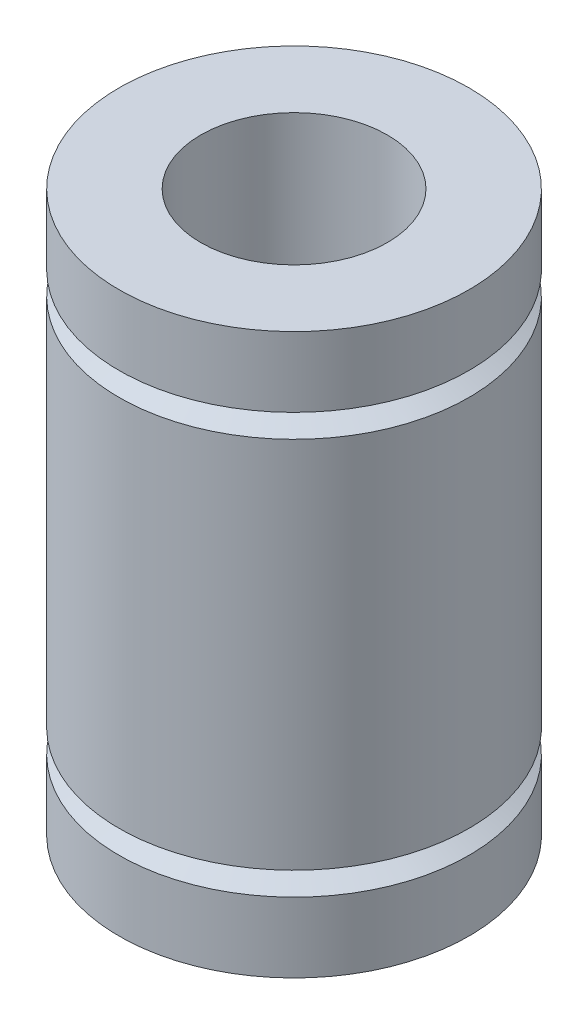
ISO-10303-21;
HEADER;
FILE_DESCRIPTION(('STEP AP214'),'2;1');
FILE_NAME('part.step','',(''),(''),'','','');
FILE_SCHEMA(('AUTOMOTIVE_DESIGN { 1 0 10303 214 1 1 1 1 }'));
ENDSEC;
DATA;
#1=APPLICATION_CONTEXT('core data for automotive mechanical design processes');
#2=APPLICATION_PROTOCOL_DEFINITION('international standard','automotive_design',2000,#1);
#3=PRODUCT_CONTEXT('',#1,'mechanical');
#4=PRODUCT('Part','Part','',(#3));
#5=PRODUCT_RELATED_PRODUCT_CATEGORY('part','',(#4));
#6=PRODUCT_DEFINITION_FORMATION('','',#4);
#7=PRODUCT_DEFINITION_CONTEXT('part definition',#1,'design');
#8=PRODUCT_DEFINITION('design','',#6,#7);
#9=PRODUCT_DEFINITION_SHAPE('','',#8);
#10=(LENGTH_UNIT() NAMED_UNIT(*) SI_UNIT(.MILLI.,.METRE.));
#11=(NAMED_UNIT(*) PLANE_ANGLE_UNIT() SI_UNIT($,.RADIAN.));
#12=(NAMED_UNIT(*) SI_UNIT($,.STERADIAN.) SOLID_ANGLE_UNIT());
#13=UNCERTAINTY_MEASURE_WITH_UNIT(LENGTH_MEASURE(1.E-05),#10,'distance_accuracy_value','');
#14=(GEOMETRIC_REPRESENTATION_CONTEXT(3) GLOBAL_UNCERTAINTY_ASSIGNED_CONTEXT((#13)) GLOBAL_UNIT_ASSIGNED_CONTEXT((#10,
#11,#12)) REPRESENTATION_CONTEXT('',''));
#15=CARTESIAN_POINT('',(0.,0.,0.));
#16=DIRECTION('',(0.,0.,1.));
#17=DIRECTION('',(1.,0.,0.));
#18=AXIS2_PLACEMENT_3D('',#15,#16,#17);
#19=CARTESIAN_POINT('',(-60.,24.,0.));
#20=DIRECTION('',(0.,-1.,0.));
#21=DIRECTION('',(0.,0.,-1.));
#22=AXIS2_PLACEMENT_3D('',#19,#20,#21);
#23=CYLINDRICAL_SURFACE('',#22,7.5);
#24=CARTESIAN_POINT('',(-60.,24.,0.));
#25=DIRECTION('',(0.,-1.,0.));
#26=DIRECTION('',(0.,0.,-1.));
#27=AXIS2_PLACEMENT_3D('',#24,#25,#26);
#28=CIRCLE('',#27,7.5);
#29=CARTESIAN_POINT('',(-60.,24.,-7.5));
#30=VERTEX_POINT('',#29);
#31=EDGE_CURVE('E10',#30,#30,#28,.T.);
#32=ORIENTED_EDGE('',*,*,#31,.T.);
#33=EDGE_LOOP('',(#32));
#34=FACE_BOUND('',#33,.T.);
#35=CARTESIAN_POINT('',(-60.,21.,0.));
#36=DIRECTION('',(0.,-1.,0.));
#37=DIRECTION('',(0.,0.,-1.));
#38=AXIS2_PLACEMENT_3D('',#35,#36,#37);
#39=CIRCLE('',#38,7.5);
#40=CARTESIAN_POINT('',(-60.,21.,-7.5));
#41=VERTEX_POINT('',#40);
#42=EDGE_CURVE('E65',#41,#41,#39,.T.);
#43=ORIENTED_EDGE('',*,*,#42,.F.);
#44=EDGE_LOOP('',(#43));
#45=FACE_BOUND('',#44,.T.);
#46=ADVANCED_FACE('F31',(#34,#45),#23,.T.);
#47=CARTESIAN_POINT('',(-52.5,24.,0.));
#48=DIRECTION('',(0.,1.,0.));
#49=DIRECTION('',(0.,0.,1.));
#50=AXIS2_PLACEMENT_3D('',#47,#48,#49);
#51=PLANE('',#50);
#52=CARTESIAN_POINT('',(-60.,24.,0.));
#53=DIRECTION('',(0.,-1.,0.));
#54=DIRECTION('',(0.,0.,-1.));
#55=AXIS2_PLACEMENT_3D('',#52,#53,#54);
#56=CIRCLE('',#55,4.);
#57=CARTESIAN_POINT('',(-60.,24.,-4.));
#58=VERTEX_POINT('',#57);
#59=EDGE_CURVE('E37',#58,#58,#56,.T.);
#60=ORIENTED_EDGE('',*,*,#59,.T.);
#61=EDGE_LOOP('',(#60));
#62=FACE_BOUND('',#61,.T.);
#63=ORIENTED_EDGE('',*,*,#31,.F.);
#64=EDGE_LOOP('',(#63));
#65=FACE_BOUND('',#64,.T.);
#66=ADVANCED_FACE('F73',(#62,#65),#51,.T.);
#67=CARTESIAN_POINT('',(-60.,24.,0.));
#68=DIRECTION('',(0.,-1.,0.));
#69=DIRECTION('',(0.,0.,-1.));
#70=AXIS2_PLACEMENT_3D('',#67,#68,#69);
#71=CYLINDRICAL_SURFACE('',#70,4.);
#72=CARTESIAN_POINT('',(-60.,0.,0.));
#73=DIRECTION('',(0.,-1.,0.));
#74=DIRECTION('',(0.,0.,-1.));
#75=AXIS2_PLACEMENT_3D('',#72,#73,#74);
#76=CIRCLE('',#75,4.);
#77=CARTESIAN_POINT('',(-60.,0.,-4.));
#78=VERTEX_POINT('',#77);
#79=EDGE_CURVE('E41',#78,#78,#76,.T.);
#80=ORIENTED_EDGE('',*,*,#79,.T.);
#81=EDGE_LOOP('',(#80));
#82=FACE_BOUND('',#81,.T.);
#83=ORIENTED_EDGE('',*,*,#59,.F.);
#84=EDGE_LOOP('',(#83));
#85=FACE_BOUND('',#84,.T.);
#86=ADVANCED_FACE('F77',(#82,#85),#71,.F.);
#87=CARTESIAN_POINT('',(-56.,0.,0.));
#88=DIRECTION('',(0.,-1.,0.));
#89=DIRECTION('',(0.,0.,-1.));
#90=AXIS2_PLACEMENT_3D('',#87,#88,#89);
#91=PLANE('',#90);
#92=CARTESIAN_POINT('',(-60.,0.,0.));
#93=DIRECTION('',(0.,-1.,0.));
#94=DIRECTION('',(0.,0.,-1.));
#95=AXIS2_PLACEMENT_3D('',#92,#93,#94);
#96=CIRCLE('',#95,7.5);
#97=CARTESIAN_POINT('',(-60.,0.,-7.5));
#98=VERTEX_POINT('',#97);
#99=EDGE_CURVE('E45',#98,#98,#96,.T.);
#100=ORIENTED_EDGE('',*,*,#99,.T.);
#101=EDGE_LOOP('',(#100));
#102=FACE_BOUND('',#101,.T.);
#103=ORIENTED_EDGE('',*,*,#79,.F.);
#104=EDGE_LOOP('',(#103));
#105=FACE_BOUND('',#104,.T.);
#106=ADVANCED_FACE('F81',(#102,#105),#91,.T.);
#107=CARTESIAN_POINT('',(-60.,24.,0.));
#108=DIRECTION('',(0.,-1.,0.));
#109=DIRECTION('',(0.,0.,-1.));
#110=AXIS2_PLACEMENT_3D('',#107,#108,#109);
#111=CYLINDRICAL_SURFACE('',#110,7.5);
#112=CARTESIAN_POINT('',(-60.,3.,0.));
#113=DIRECTION('',(0.,-1.,0.));
#114=DIRECTION('',(0.,0.,-1.));
#115=AXIS2_PLACEMENT_3D('',#112,#113,#114);
#116=CIRCLE('',#115,7.5);
#117=CARTESIAN_POINT('',(-60.,3.,-7.5));
#118=VERTEX_POINT('',#117);
#119=EDGE_CURVE('E50',#118,#118,#116,.T.);
#120=ORIENTED_EDGE('',*,*,#119,.T.);
#121=EDGE_LOOP('',(#120));
#122=FACE_BOUND('',#121,.T.);
#123=ORIENTED_EDGE('',*,*,#99,.F.);
#124=EDGE_LOOP('',(#123));
#125=FACE_BOUND('',#124,.T.);
#126=ADVANCED_FACE('F88',(#122,#125),#111,.T.);
#127=CARTESIAN_POINT('',(-60.,3.,0.));
#128=DIRECTION('',(0.,-1.,0.));
#129=DIRECTION('',(0.,0.,-1.));
#130=AXIS2_PLACEMENT_3D('',#127,#128,#129);
#131=CONICAL_SURFACE('',#130,7.5,1.10714871779409);
#132=CARTESIAN_POINT('',(-60.,3.5,0.));
#133=DIRECTION('',(0.,-1.,0.));
#134=DIRECTION('',(0.,0.,-1.));
#135=AXIS2_PLACEMENT_3D('',#132,#133,#134);
#136=CIRCLE('',#135,6.5);
#137=CARTESIAN_POINT('',(-60.,3.5,-6.5));
#138=VERTEX_POINT('',#137);
#139=EDGE_CURVE('E53',#138,#138,#136,.T.);
#140=ORIENTED_EDGE('',*,*,#139,.T.);
#141=EDGE_LOOP('',(#140));
#142=FACE_BOUND('',#141,.T.);
#143=ORIENTED_EDGE('',*,*,#119,.F.);
#144=EDGE_LOOP('',(#143));
#145=FACE_BOUND('',#144,.T.);
#146=ADVANCED_FACE('F92',(#142,#145),#131,.T.);
#147=CARTESIAN_POINT('',(-60.,3.5,0.));
#148=DIRECTION('',(0.,1.,0.));
#149=DIRECTION('',(0.,0.,1.));
#150=AXIS2_PLACEMENT_3D('',#147,#148,#149);
#151=CONICAL_SURFACE('',#150,6.5,1.10714871779409);
#152=CARTESIAN_POINT('',(-60.,4.,0.));
#153=DIRECTION('',(0.,-1.,0.));
#154=DIRECTION('',(0.,0.,-1.));
#155=AXIS2_PLACEMENT_3D('',#152,#153,#154);
#156=CIRCLE('',#155,7.5);
#157=CARTESIAN_POINT('',(-60.,4.,-7.5));
#158=VERTEX_POINT('',#157);
#159=EDGE_CURVE('E56',#158,#158,#156,.T.);
#160=ORIENTED_EDGE('',*,*,#159,.T.);
#161=EDGE_LOOP('',(#160));
#162=FACE_BOUND('',#161,.T.);
#163=ORIENTED_EDGE('',*,*,#139,.F.);
#164=EDGE_LOOP('',(#163));
#165=FACE_BOUND('',#164,.T.);
#166=ADVANCED_FACE('F96',(#162,#165),#151,.T.);
#167=CARTESIAN_POINT('',(-60.,24.,0.));
#168=DIRECTION('',(0.,-1.,0.));
#169=DIRECTION('',(0.,0.,-1.));
#170=AXIS2_PLACEMENT_3D('',#167,#168,#169);
#171=CYLINDRICAL_SURFACE('',#170,7.5);
#172=CARTESIAN_POINT('',(-60.,20.,0.));
#173=DIRECTION('',(0.,-1.,0.));
#174=DIRECTION('',(0.,0.,-1.));
#175=AXIS2_PLACEMENT_3D('',#172,#173,#174);
#176=CIRCLE('',#175,7.50000000000001);
#177=CARTESIAN_POINT('',(-60.,20.,-7.50000000000001));
#178=VERTEX_POINT('',#177);
#179=EDGE_CURVE('E59',#178,#178,#176,.T.);
#180=ORIENTED_EDGE('',*,*,#179,.T.);
#181=EDGE_LOOP('',(#180));
#182=FACE_BOUND('',#181,.T.);
#183=ORIENTED_EDGE('',*,*,#159,.F.);
#184=EDGE_LOOP('',(#183));
#185=FACE_BOUND('',#184,.T.);
#186=ADVANCED_FACE('F100',(#182,#185),#171,.T.);
#187=CARTESIAN_POINT('',(-60.,20.,0.));
#188=DIRECTION('',(0.,-1.,0.));
#189=DIRECTION('',(0.,0.,-1.));
#190=AXIS2_PLACEMENT_3D('',#187,#188,#189);
#191=CONICAL_SURFACE('',#190,7.50000000000001,1.10714871779409);
#192=CARTESIAN_POINT('',(-60.,20.5,0.));
#193=DIRECTION('',(0.,-1.,0.));
#194=DIRECTION('',(0.,0.,-1.));
#195=AXIS2_PLACEMENT_3D('',#192,#193,#194);
#196=CIRCLE('',#195,6.5);
#197=CARTESIAN_POINT('',(-60.,20.5,-6.5));
#198=VERTEX_POINT('',#197);
#199=EDGE_CURVE('E62',#198,#198,#196,.T.);
#200=ORIENTED_EDGE('',*,*,#199,.T.);
#201=EDGE_LOOP('',(#200));
#202=FACE_BOUND('',#201,.T.);
#203=ORIENTED_EDGE('',*,*,#179,.F.);
#204=EDGE_LOOP('',(#203));
#205=FACE_BOUND('',#204,.T.);
#206=ADVANCED_FACE('F104',(#202,#205),#191,.T.);
#207=CARTESIAN_POINT('',(-60.,20.5,0.));
#208=DIRECTION('',(0.,1.,0.));
#209=DIRECTION('',(0.,0.,1.));
#210=AXIS2_PLACEMENT_3D('',#207,#208,#209);
#211=CONICAL_SURFACE('',#210,6.5,1.10714871779409);
#212=ORIENTED_EDGE('',*,*,#42,.T.);
#213=EDGE_LOOP('',(#212));
#214=FACE_BOUND('',#213,.T.);
#215=ORIENTED_EDGE('',*,*,#199,.F.);
#216=EDGE_LOOP('',(#215));
#217=FACE_BOUND('',#216,.T.);
#218=ADVANCED_FACE('F69',(#214,#217),#211,.T.);
#219=CLOSED_SHELL('',(#46,#66,#86,#106,#126,#146,#166,#186,#206,#218));
#220=MANIFOLD_SOLID_BREP('B2',#219);
#221=ADVANCED_BREP_SHAPE_REPRESENTATION('',(#18,#220),#14);
#222=SHAPE_DEFINITION_REPRESENTATION(#9,#221);
ENDSEC;
END-ISO-10303-21;
